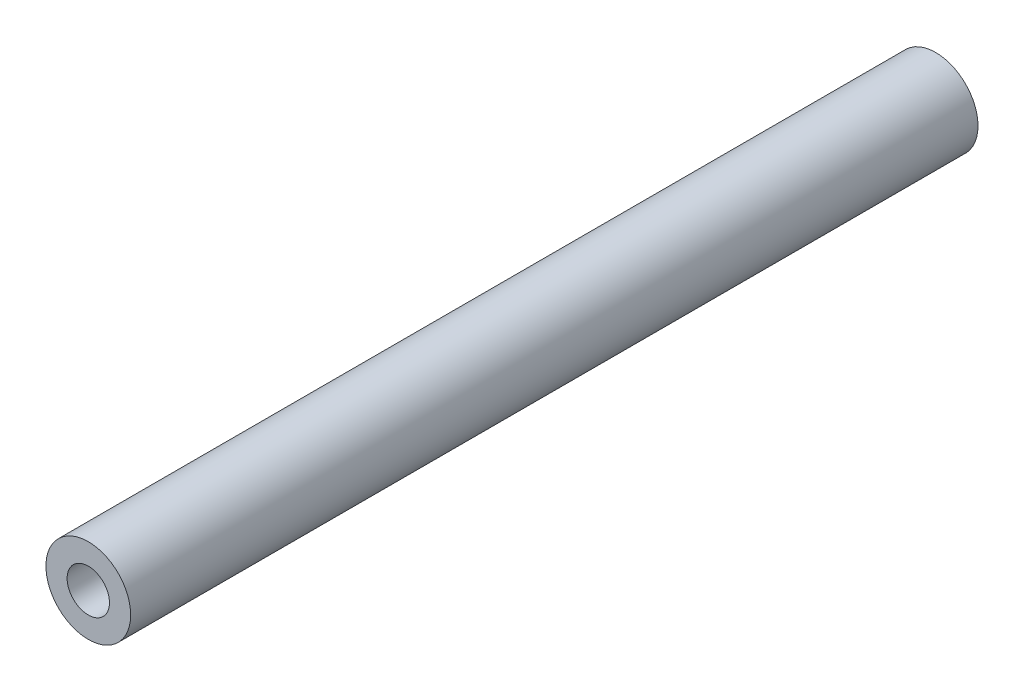
ISO-10303-21;
HEADER;
FILE_DESCRIPTION(('STEP AP214'),'2;1');
FILE_NAME('part.step','',(''),(''),'','','');
FILE_SCHEMA(('AUTOMOTIVE_DESIGN { 1 0 10303 214 1 1 1 1 }'));
ENDSEC;
DATA;
#1=APPLICATION_CONTEXT('core data for automotive mechanical design processes');
#2=APPLICATION_PROTOCOL_DEFINITION('international standard','automotive_design',2000,#1);
#3=PRODUCT_CONTEXT('',#1,'mechanical');
#4=PRODUCT('Part','Part','',(#3));
#5=PRODUCT_RELATED_PRODUCT_CATEGORY('part','',(#4));
#6=PRODUCT_DEFINITION_FORMATION('','',#4);
#7=PRODUCT_DEFINITION_CONTEXT('part definition',#1,'design');
#8=PRODUCT_DEFINITION('design','',#6,#7);
#9=PRODUCT_DEFINITION_SHAPE('','',#8);
#10=(LENGTH_UNIT() NAMED_UNIT(*) SI_UNIT(.MILLI.,.METRE.));
#11=(NAMED_UNIT(*) PLANE_ANGLE_UNIT() SI_UNIT($,.RADIAN.));
#12=(NAMED_UNIT(*) SI_UNIT($,.STERADIAN.) SOLID_ANGLE_UNIT());
#13=UNCERTAINTY_MEASURE_WITH_UNIT(LENGTH_MEASURE(1.E-05),#10,'distance_accuracy_value','');
#14=(GEOMETRIC_REPRESENTATION_CONTEXT(3) GLOBAL_UNCERTAINTY_ASSIGNED_CONTEXT((#13)) GLOBAL_UNIT_ASSIGNED_CONTEXT((#10,
#11,#12)) REPRESENTATION_CONTEXT('',''));
#15=CARTESIAN_POINT('',(0.,0.,0.));
#16=DIRECTION('',(0.,0.,1.));
#17=DIRECTION('',(1.,0.,0.));
#18=AXIS2_PLACEMENT_3D('',#15,#16,#17);
#19=CARTESIAN_POINT('',(0.,0.,50.));
#20=DIRECTION('',(0.,0.,-1.));
#21=DIRECTION('',(-1.,0.,0.));
#22=AXIS2_PLACEMENT_3D('',#19,#20,#21);
#23=CYLINDRICAL_SURFACE('',#22,2.5);
#24=CARTESIAN_POINT('',(0.,0.,50.));
#25=DIRECTION('',(0.,0.,1.));
#26=DIRECTION('',(1.,0.,0.));
#27=AXIS2_PLACEMENT_3D('',#24,#25,#26);
#28=CIRCLE('',#27,2.5);
#29=CARTESIAN_POINT('',(2.5,0.,50.));
#30=VERTEX_POINT('',#29);
#31=EDGE_CURVE('E10',#30,#30,#28,.T.);
#32=ORIENTED_EDGE('',*,*,#31,.F.);
#33=EDGE_LOOP('',(#32));
#34=FACE_BOUND('',#33,.T.);
#35=CARTESIAN_POINT('',(0.,0.,0.));
#36=DIRECTION('',(0.,0.,1.));
#37=DIRECTION('',(1.,0.,0.));
#38=AXIS2_PLACEMENT_3D('',#35,#36,#37);
#39=CIRCLE('',#38,2.5);
#40=CARTESIAN_POINT('',(2.5,0.,0.));
#41=VERTEX_POINT('',#40);
#42=EDGE_CURVE('E38',#41,#41,#39,.T.);
#43=ORIENTED_EDGE('',*,*,#42,.T.);
#44=EDGE_LOOP('',(#43));
#45=FACE_BOUND('',#44,.T.);
#46=ADVANCED_FACE('F35',(#34,#45),#23,.T.);
#47=CARTESIAN_POINT('',(0.,0.,50.));
#48=DIRECTION('',(0.,0.,1.));
#49=DIRECTION('',(1.,0.,0.));
#50=AXIS2_PLACEMENT_3D('',#47,#48,#49);
#51=PLANE('',#50);
#52=CARTESIAN_POINT('',(0.,0.,50.));
#53=DIRECTION('',(0.,0.,1.));
#54=DIRECTION('',(1.,0.,0.));
#55=AXIS2_PLACEMENT_3D('',#52,#53,#54);
#56=CIRCLE('',#55,1.25);
#57=CARTESIAN_POINT('',(1.25,0.,50.));
#58=VERTEX_POINT('',#57);
#59=EDGE_CURVE('E49',#58,#58,#56,.T.);
#60=ORIENTED_EDGE('',*,*,#59,.F.);
#61=EDGE_LOOP('',(#60));
#62=FACE_BOUND('',#61,.T.);
#63=ORIENTED_EDGE('',*,*,#31,.T.);
#64=EDGE_LOOP('',(#63));
#65=FACE_BOUND('',#64,.T.);
#66=ADVANCED_FACE('F55',(#62,#65),#51,.T.);
#67=CARTESIAN_POINT('',(0.,0.,0.));
#68=DIRECTION('',(0.,0.,1.));
#69=DIRECTION('',(1.,0.,0.));
#70=AXIS2_PLACEMENT_3D('',#67,#68,#69);
#71=PLANE('',#70);
#72=CARTESIAN_POINT('',(0.,0.,0.));
#73=DIRECTION('',(0.,0.,1.));
#74=DIRECTION('',(1.,0.,0.));
#75=AXIS2_PLACEMENT_3D('',#72,#73,#74);
#76=CIRCLE('',#75,1.24999999999999);
#77=CARTESIAN_POINT('',(1.24999999999999,0.,0.));
#78=VERTEX_POINT('',#77);
#79=EDGE_CURVE('E45',#78,#78,#76,.T.);
#80=ORIENTED_EDGE('',*,*,#79,.T.);
#81=EDGE_LOOP('',(#80));
#82=FACE_BOUND('',#81,.T.);
#83=ORIENTED_EDGE('',*,*,#42,.F.);
#84=EDGE_LOOP('',(#83));
#85=FACE_BOUND('',#84,.T.);
#86=ADVANCED_FACE('F57',(#82,#85),#71,.F.);
#87=CARTESIAN_POINT('',(0.,0.,50.));
#88=DIRECTION('',(0.,0.,1.));
#89=DIRECTION('',(1.,0.,0.));
#90=AXIS2_PLACEMENT_3D('',#87,#88,#89);
#91=CYLINDRICAL_SURFACE('',#90,1.24999999999999);
#92=ORIENTED_EDGE('',*,*,#79,.F.);
#93=EDGE_LOOP('',(#92));
#94=FACE_BOUND('',#93,.T.);
#95=ORIENTED_EDGE('',*,*,#59,.T.);
#96=EDGE_LOOP('',(#95));
#97=FACE_BOUND('',#96,.T.);
#98=ADVANCED_FACE('F53',(#94,#97),#91,.F.);
#99=CLOSED_SHELL('',(#46,#66,#86,#98));
#100=MANIFOLD_SOLID_BREP('B2',#99);
#101=ADVANCED_BREP_SHAPE_REPRESENTATION('',(#18,#100),#14);
#102=SHAPE_DEFINITION_REPRESENTATION(#9,#101);
ENDSEC;
END-ISO-10303-21;
